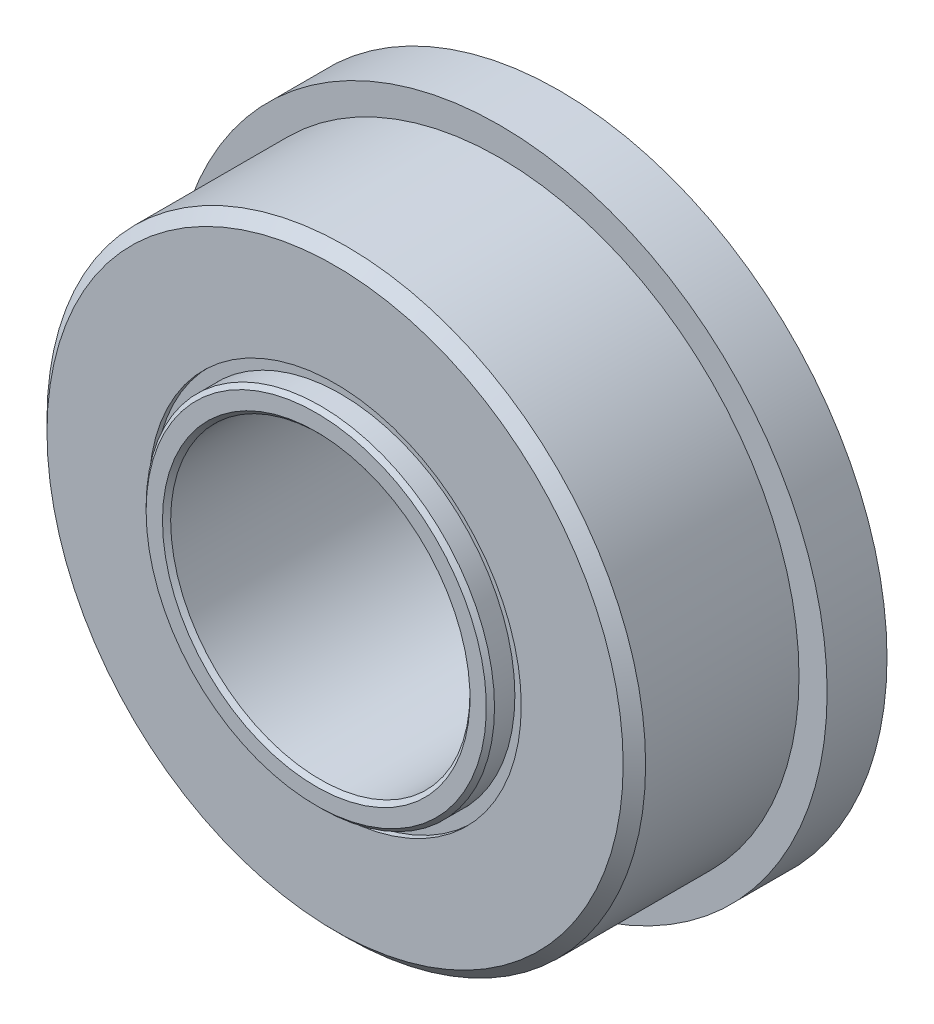
ISO-10303-21;
HEADER;
FILE_DESCRIPTION(('STEP AP214'),'2;1');
FILE_NAME('part.step','',(''),(''),'','','');
FILE_SCHEMA(('AUTOMOTIVE_DESIGN { 1 0 10303 214 1 1 1 1 }'));
ENDSEC;
DATA;
#1=APPLICATION_CONTEXT('core data for automotive mechanical design processes');
#2=APPLICATION_PROTOCOL_DEFINITION('international standard','automotive_design',2000,#1);
#3=PRODUCT_CONTEXT('',#1,'mechanical');
#4=PRODUCT('Part','Part','',(#3));
#5=PRODUCT_RELATED_PRODUCT_CATEGORY('part','',(#4));
#6=PRODUCT_DEFINITION_FORMATION('','',#4);
#7=PRODUCT_DEFINITION_CONTEXT('part definition',#1,'design');
#8=PRODUCT_DEFINITION('design','',#6,#7);
#9=PRODUCT_DEFINITION_SHAPE('','',#8);
#10=(LENGTH_UNIT() NAMED_UNIT(*) SI_UNIT(.MILLI.,.METRE.));
#11=(NAMED_UNIT(*) PLANE_ANGLE_UNIT() SI_UNIT($,.RADIAN.));
#12=(NAMED_UNIT(*) SI_UNIT($,.STERADIAN.) SOLID_ANGLE_UNIT());
#13=UNCERTAINTY_MEASURE_WITH_UNIT(LENGTH_MEASURE(1.E-05),#10,'distance_accuracy_value','');
#14=(GEOMETRIC_REPRESENTATION_CONTEXT(3) GLOBAL_UNCERTAINTY_ASSIGNED_CONTEXT((#13)) GLOBAL_UNIT_ASSIGNED_CONTEXT((#10,
#11,#12)) REPRESENTATION_CONTEXT('',''));
#15=CARTESIAN_POINT('',(0.,0.,0.));
#16=DIRECTION('',(0.,0.,1.));
#17=DIRECTION('',(1.,0.,0.));
#18=AXIS2_PLACEMENT_3D('',#15,#16,#17);
#19=CARTESIAN_POINT('',(0.,3.9497,-2.2621875));
#20=DIRECTION('',(0.,0.,1.));
#21=DIRECTION('',(1.,0.,0.));
#22=AXIS2_PLACEMENT_3D('',#19,#20,#21);
#23=PLANE('',#22);
#24=CARTESIAN_POINT('',(0.,0.,-2.2621875));
#25=DIRECTION('',(0.,0.,1.));
#26=DIRECTION('',(1.,0.,0.));
#27=AXIS2_PLACEMENT_3D('',#24,#25,#26);
#28=CIRCLE('',#27,3.9497);
#29=CARTESIAN_POINT('',(3.9497,0.,-2.2621875));
#30=VERTEX_POINT('',#29);
#31=EDGE_CURVE('E58',#30,#30,#28,.T.);
#32=ORIENTED_EDGE('',*,*,#31,.F.);
#33=EDGE_LOOP('',(#32));
#34=FACE_BOUND('',#33,.T.);
#35=CARTESIAN_POINT('',(0.,0.,-2.2621875));
#36=DIRECTION('',(0.,0.,1.));
#37=DIRECTION('',(1.,0.,0.));
#38=AXIS2_PLACEMENT_3D('',#35,#36,#37);
#39=CIRCLE('',#38,3.6957);
#40=CARTESIAN_POINT('',(3.6957,0.,-2.2621875));
#41=VERTEX_POINT('',#40);
#42=EDGE_CURVE('E11',#41,#41,#39,.T.);
#43=ORIENTED_EDGE('',*,*,#42,.T.);
#44=EDGE_LOOP('',(#43));
#45=FACE_BOUND('',#44,.T.);
#46=ADVANCED_FACE('F44',(#34,#45),#23,.F.);
#47=CARTESIAN_POINT('',(0.,0.,2.38125));
#48=DIRECTION('',(0.,0.,1.));
#49=DIRECTION('',(1.,0.,0.));
#50=AXIS2_PLACEMENT_3D('',#47,#48,#49);
#51=CYLINDRICAL_SURFACE('',#50,3.6957);
#52=ORIENTED_EDGE('',*,*,#42,.F.);
#53=EDGE_LOOP('',(#52));
#54=FACE_BOUND('',#53,.T.);
#55=CARTESIAN_POINT('',(0.,0.,-0.793750000000001));
#56=DIRECTION('',(0.,0.,1.));
#57=DIRECTION('',(1.,0.,0.));
#58=AXIS2_PLACEMENT_3D('',#55,#56,#57);
#59=CIRCLE('',#58,3.6957);
#60=CARTESIAN_POINT('',(3.6957,0.,-0.793750000000001));
#61=VERTEX_POINT('',#60);
#62=EDGE_CURVE('E50',#61,#61,#59,.T.);
#63=ORIENTED_EDGE('',*,*,#62,.T.);
#64=EDGE_LOOP('',(#63));
#65=FACE_BOUND('',#64,.T.);
#66=ADVANCED_FACE('F67',(#54,#65),#51,.F.);
#67=CARTESIAN_POINT('',(0.,3.9497,-0.793750000000001));
#68=DIRECTION('',(0.,0.,-1.));
#69=DIRECTION('',(-1.,0.,0.));
#70=AXIS2_PLACEMENT_3D('',#67,#68,#69);
#71=PLANE('',#70);
#72=ORIENTED_EDGE('',*,*,#62,.F.);
#73=EDGE_LOOP('',(#72));
#74=FACE_BOUND('',#73,.T.);
#75=CARTESIAN_POINT('',(0.,0.,-0.793750000000001));
#76=DIRECTION('',(0.,0.,1.));
#77=DIRECTION('',(1.,0.,0.));
#78=AXIS2_PLACEMENT_3D('',#75,#76,#77);
#79=CIRCLE('',#78,3.9497);
#80=CARTESIAN_POINT('',(3.9497,0.,-0.793750000000001));
#81=VERTEX_POINT('',#80);
#82=EDGE_CURVE('E54',#81,#81,#79,.T.);
#83=ORIENTED_EDGE('',*,*,#82,.T.);
#84=EDGE_LOOP('',(#83));
#85=FACE_BOUND('',#84,.T.);
#86=ADVANCED_FACE('F71',(#74,#85),#71,.F.);
#87=CARTESIAN_POINT('',(0.,0.,2.38125));
#88=DIRECTION('',(0.,0.,1.));
#89=DIRECTION('',(1.,0.,0.));
#90=AXIS2_PLACEMENT_3D('',#87,#88,#89);
#91=CYLINDRICAL_SURFACE('',#90,3.9497);
#92=ORIENTED_EDGE('',*,*,#82,.F.);
#93=EDGE_LOOP('',(#92));
#94=FACE_BOUND('',#93,.T.);
#95=ORIENTED_EDGE('',*,*,#31,.T.);
#96=EDGE_LOOP('',(#95));
#97=FACE_BOUND('',#96,.T.);
#98=ADVANCED_FACE('F64',(#94,#97),#91,.T.);
#99=CLOSED_SHELL('',(#46,#66,#86,#98));
#100=MANIFOLD_SOLID_BREP('B2',#99);
#101=CARTESIAN_POINT('',(0.,3.9497,2.2621875));
#102=DIRECTION('',(0.,0.,-1.));
#103=DIRECTION('',(-1.,0.,0.));
#104=AXIS2_PLACEMENT_3D('',#101,#102,#103);
#105=PLANE('',#104);
#106=CARTESIAN_POINT('',(0.,0.,2.2621875));
#107=DIRECTION('',(0.,0.,1.));
#108=DIRECTION('',(1.,0.,0.));
#109=AXIS2_PLACEMENT_3D('',#106,#107,#108);
#110=CIRCLE('',#109,3.6957);
#111=CARTESIAN_POINT('',(3.6957,0.,2.2621875));
#112=VERTEX_POINT('',#111);
#113=EDGE_CURVE('E43',#112,#112,#110,.T.);
#114=ORIENTED_EDGE('',*,*,#113,.F.);
#115=EDGE_LOOP('',(#114));
#116=FACE_BOUND('',#115,.T.);
#117=CARTESIAN_POINT('',(0.,0.,2.2621875));
#118=DIRECTION('',(0.,0.,1.));
#119=DIRECTION('',(1.,0.,0.));
#120=AXIS2_PLACEMENT_3D('',#117,#118,#119);
#121=CIRCLE('',#120,3.9497);
#122=CARTESIAN_POINT('',(3.9497,0.,2.2621875));
#123=VERTEX_POINT('',#122);
#124=EDGE_CURVE('E126',#123,#123,#121,.T.);
#125=ORIENTED_EDGE('',*,*,#124,.T.);
#126=EDGE_LOOP('',(#125));
#127=FACE_BOUND('',#126,.T.);
#128=ADVANCED_FACE('F112',(#116,#127),#105,.F.);
#129=CARTESIAN_POINT('',(0.,0.,2.38125));
#130=DIRECTION('',(0.,0.,1.));
#131=DIRECTION('',(1.,0.,0.));
#132=AXIS2_PLACEMENT_3D('',#129,#130,#131);
#133=CYLINDRICAL_SURFACE('',#132,3.6957);
#134=CARTESIAN_POINT('',(0.,0.,0.79375));
#135=DIRECTION('',(0.,0.,1.));
#136=DIRECTION('',(1.,0.,0.));
#137=AXIS2_PLACEMENT_3D('',#134,#135,#136);
#138=CIRCLE('',#137,3.6957);
#139=CARTESIAN_POINT('',(3.6957,0.,0.79375));
#140=VERTEX_POINT('',#139);
#141=EDGE_CURVE('E118',#140,#140,#138,.T.);
#142=ORIENTED_EDGE('',*,*,#141,.F.);
#143=EDGE_LOOP('',(#142));
#144=FACE_BOUND('',#143,.T.);
#145=ORIENTED_EDGE('',*,*,#113,.T.);
#146=EDGE_LOOP('',(#145));
#147=FACE_BOUND('',#146,.T.);
#148=ADVANCED_FACE('F141',(#144,#147),#133,.F.);
#149=CARTESIAN_POINT('',(0.,3.9497,0.79375));
#150=DIRECTION('',(0.,0.,1.));
#151=DIRECTION('',(1.,0.,0.));
#152=AXIS2_PLACEMENT_3D('',#149,#150,#151);
#153=PLANE('',#152);
#154=CARTESIAN_POINT('',(0.,0.,0.79375));
#155=DIRECTION('',(0.,0.,1.));
#156=DIRECTION('',(1.,0.,0.));
#157=AXIS2_PLACEMENT_3D('',#154,#155,#156);
#158=CIRCLE('',#157,3.9497);
#159=CARTESIAN_POINT('',(3.9497,0.,0.79375));
#160=VERTEX_POINT('',#159);
#161=EDGE_CURVE('E122',#160,#160,#158,.T.);
#162=ORIENTED_EDGE('',*,*,#161,.F.);
#163=EDGE_LOOP('',(#162));
#164=FACE_BOUND('',#163,.T.);
#165=ORIENTED_EDGE('',*,*,#141,.T.);
#166=EDGE_LOOP('',(#165));
#167=FACE_BOUND('',#166,.T.);
#168=ADVANCED_FACE('F136',(#164,#167),#153,.F.);
#169=CARTESIAN_POINT('',(0.,0.,2.38125));
#170=DIRECTION('',(0.,0.,1.));
#171=DIRECTION('',(1.,0.,0.));
#172=AXIS2_PLACEMENT_3D('',#169,#170,#171);
#173=CYLINDRICAL_SURFACE('',#172,3.9497);
#174=ORIENTED_EDGE('',*,*,#124,.F.);
#175=EDGE_LOOP('',(#174));
#176=FACE_BOUND('',#175,.T.);
#177=ORIENTED_EDGE('',*,*,#161,.T.);
#178=EDGE_LOOP('',(#177));
#179=FACE_BOUND('',#178,.T.);
#180=ADVANCED_FACE('F133',(#176,#179),#173,.T.);
#181=CLOSED_SHELL('',(#128,#148,#168,#180));
#182=MANIFOLD_SOLID_BREP('B6',#181);
#183=CARTESIAN_POINT('',(-2.11454999999995,3.6625080351448,0.));
#184=DIRECTION('',(0.,0.,1.));
#185=DIRECTION('',(-0.499999999999989,0.866025403784445,0.));
#186=AXIS2_PLACEMENT_3D('',#183,#184,#185);
#187=SPHERICAL_SURFACE('',#186,0.79375);
#188=CARTESIAN_POINT('',(-2.11454999999995,3.6625080351448,0.79375));
#189=VERTEX_POINT('',#188);
#190=VERTEX_LOOP('',#189);
#191=FACE_BOUND('',#190,.T.);
#192=ADVANCED_FACE('F180',(#191),#187,.T.);
#193=CLOSED_SHELL('',(#192));
#194=MANIFOLD_SOLID_BREP('B38',#193);
#195=CARTESIAN_POINT('',(-3.66250803514474,2.11455000000004,0.));
#196=DIRECTION('',(0.,0.,1.));
#197=DIRECTION('',(-0.866025403784433,0.50000000000001,0.));
#198=AXIS2_PLACEMENT_3D('',#195,#196,#197);
#199=SPHERICAL_SURFACE('',#198,0.79375);
#200=CARTESIAN_POINT('',(-3.66250803514474,2.11455000000004,0.79375));
#201=VERTEX_POINT('',#200);
#202=VERTEX_LOOP('',#201);
#203=FACE_BOUND('',#202,.T.);
#204=ADVANCED_FACE('F201',(#203),#199,.T.);
#205=CLOSED_SHELL('',(#204));
#206=MANIFOLD_SOLID_BREP('B108',#205);
#207=CARTESIAN_POINT('',(-4.2291,0.,0.));
#208=DIRECTION('',(0.,0.,1.));
#209=DIRECTION('',(-1.,0.,0.));
#210=AXIS2_PLACEMENT_3D('',#207,#208,#209);
#211=SPHERICAL_SURFACE('',#210,0.79375);
#212=CARTESIAN_POINT('',(-4.2291,0.,0.79375));
#213=VERTEX_POINT('',#212);
#214=VERTEX_LOOP('',#213);
#215=FACE_BOUND('',#214,.T.);
#216=ADVANCED_FACE('F222',(#215),#211,.T.);
#217=CLOSED_SHELL('',(#216));
#218=MANIFOLD_SOLID_BREP('B176',#217);
#219=CARTESIAN_POINT('',(-3.66250803514479,-2.11454999999997,0.));
#220=DIRECTION('',(0.,0.,1.));
#221=DIRECTION('',(-0.866025403784443,-0.499999999999992,0.));
#222=AXIS2_PLACEMENT_3D('',#219,#220,#221);
#223=SPHERICAL_SURFACE('',#222,0.79375);
#224=CARTESIAN_POINT('',(-3.66250803514479,-2.11454999999997,0.79375));
#225=VERTEX_POINT('',#224);
#226=VERTEX_LOOP('',#225);
#227=FACE_BOUND('',#226,.T.);
#228=ADVANCED_FACE('F243',(#227),#223,.T.);
#229=CLOSED_SHELL('',(#228));
#230=MANIFOLD_SOLID_BREP('B197',#229);
#231=CARTESIAN_POINT('',(-2.11455000000003,-3.66250803514475,0.));
#232=DIRECTION('',(0.,0.,1.));
#233=DIRECTION('',(-0.500000000000007,-0.866025403784435,0.));
#234=AXIS2_PLACEMENT_3D('',#231,#232,#233);
#235=SPHERICAL_SURFACE('',#234,0.79375);
#236=CARTESIAN_POINT('',(-2.11455000000003,-3.66250803514475,0.79375));
#237=VERTEX_POINT('',#236);
#238=VERTEX_LOOP('',#237);
#239=FACE_BOUND('',#238,.T.);
#240=ADVANCED_FACE('F264',(#239),#235,.T.);
#241=CLOSED_SHELL('',(#240));
#242=MANIFOLD_SOLID_BREP('B218',#241);
#243=CARTESIAN_POINT('',(0.,-4.2291,0.));
#244=DIRECTION('',(0.,0.,1.));
#245=DIRECTION('',(0.,-1.,0.));
#246=AXIS2_PLACEMENT_3D('',#243,#244,#245);
#247=SPHERICAL_SURFACE('',#246,0.79375);
#248=CARTESIAN_POINT('',(0.,-4.2291,0.79375));
#249=VERTEX_POINT('',#248);
#250=VERTEX_LOOP('',#249);
#251=FACE_BOUND('',#250,.T.);
#252=ADVANCED_FACE('F285',(#251),#247,.T.);
#253=CLOSED_SHELL('',(#252));
#254=MANIFOLD_SOLID_BREP('B239',#253);
#255=CARTESIAN_POINT('',(2.11454999999998,-3.66250803514478,0.));
#256=DIRECTION('',(0.,0.,1.));
#257=DIRECTION('',(0.499999999999995,-0.866025403784442,0.));
#258=AXIS2_PLACEMENT_3D('',#255,#256,#257);
#259=SPHERICAL_SURFACE('',#258,0.79375);
#260=CARTESIAN_POINT('',(2.11454999999998,-3.66250803514478,0.79375));
#261=VERTEX_POINT('',#260);
#262=VERTEX_LOOP('',#261);
#263=FACE_BOUND('',#262,.T.);
#264=ADVANCED_FACE('F306',(#263),#259,.T.);
#265=CLOSED_SHELL('',(#264));
#266=MANIFOLD_SOLID_BREP('B260',#265);
#267=CARTESIAN_POINT('',(3.66250803514476,-2.11455000000002,0.));
#268=DIRECTION('',(0.,0.,1.));
#269=DIRECTION('',(0.866025403784436,-0.500000000000004,0.));
#270=AXIS2_PLACEMENT_3D('',#267,#268,#269);
#271=SPHERICAL_SURFACE('',#270,0.79375);
#272=CARTESIAN_POINT('',(3.66250803514476,-2.11455000000002,0.79375));
#273=VERTEX_POINT('',#272);
#274=VERTEX_LOOP('',#273);
#275=FACE_BOUND('',#274,.T.);
#276=ADVANCED_FACE('F327',(#275),#271,.T.);
#277=CLOSED_SHELL('',(#276));
#278=MANIFOLD_SOLID_BREP('B281',#277);
#279=CARTESIAN_POINT('',(4.2291,0.,0.));
#280=DIRECTION('',(0.,0.,1.));
#281=DIRECTION('',(1.,0.,0.));
#282=AXIS2_PLACEMENT_3D('',#279,#280,#281);
#283=SPHERICAL_SURFACE('',#282,0.79375);
#284=CARTESIAN_POINT('',(4.2291,0.,0.79375));
#285=VERTEX_POINT('',#284);
#286=VERTEX_LOOP('',#285);
#287=FACE_BOUND('',#286,.T.);
#288=ADVANCED_FACE('F348',(#287),#283,.T.);
#289=CLOSED_SHELL('',(#288));
#290=MANIFOLD_SOLID_BREP('B302',#289);
#291=CARTESIAN_POINT('',(3.66250803514477,2.11454999999999,0.));
#292=DIRECTION('',(0.,0.,1.));
#293=DIRECTION('',(0.86602540378444,0.499999999999998,0.));
#294=AXIS2_PLACEMENT_3D('',#291,#292,#293);
#295=SPHERICAL_SURFACE('',#294,0.79375);
#296=CARTESIAN_POINT('',(3.66250803514477,2.11454999999999,0.79375));
#297=VERTEX_POINT('',#296);
#298=VERTEX_LOOP('',#297);
#299=FACE_BOUND('',#298,.T.);
#300=ADVANCED_FACE('F369',(#299),#295,.T.);
#301=CLOSED_SHELL('',(#300));
#302=MANIFOLD_SOLID_BREP('B323',#301);
#303=CARTESIAN_POINT('',(2.11455,3.66250803514477,0.));
#304=DIRECTION('',(0.,0.,1.));
#305=DIRECTION('',(0.500000000000001,0.866025403784438,0.));
#306=AXIS2_PLACEMENT_3D('',#303,#304,#305);
#307=SPHERICAL_SURFACE('',#306,0.79375);
#308=CARTESIAN_POINT('',(2.11455,3.66250803514477,0.79375));
#309=VERTEX_POINT('',#308);
#310=VERTEX_LOOP('',#309);
#311=FACE_BOUND('',#310,.T.);
#312=ADVANCED_FACE('F390',(#311),#307,.T.);
#313=CLOSED_SHELL('',(#312));
#314=MANIFOLD_SOLID_BREP('B344',#313);
#315=CARTESIAN_POINT('',(0.,4.2291,0.));
#316=DIRECTION('',(0.,0.,1.));
#317=DIRECTION('',(0.,1.,0.));
#318=AXIS2_PLACEMENT_3D('',#315,#316,#317);
#319=SPHERICAL_SURFACE('',#318,0.79375);
#320=CARTESIAN_POINT('',(0.,4.2291,0.79375));
#321=VERTEX_POINT('',#320);
#322=VERTEX_LOOP('',#321);
#323=FACE_BOUND('',#322,.T.);
#324=ADVANCED_FACE('F413',(#323),#319,.T.);
#325=CLOSED_SHELL('',(#324));
#326=MANIFOLD_SOLID_BREP('B365',#325);
#327=CARTESIAN_POINT('',(0.,0.,2.38125));
#328=DIRECTION('',(0.,0.,1.));
#329=DIRECTION('',(1.,0.,0.));
#330=AXIS2_PLACEMENT_3D('',#327,#328,#329);
#331=CYLINDRICAL_SURFACE('',#330,3.6957);
#332=CARTESIAN_POINT('',(0.,0.,2.69451666666667));
#333=DIRECTION('',(0.,0.,-1.));
#334=DIRECTION('',(-1.,0.,0.));
#335=AXIS2_PLACEMENT_3D('',#332,#333,#334);
#336=CIRCLE('',#335,3.6957);
#337=CARTESIAN_POINT('',(-3.6957,0.,2.69451666666667));
#338=VERTEX_POINT('',#337);
#339=EDGE_CURVE('E412',#338,#338,#336,.T.);
#340=ORIENTED_EDGE('',*,*,#339,.T.);
#341=EDGE_LOOP('',(#340));
#342=FACE_BOUND('',#341,.T.);
#343=CARTESIAN_POINT('',(0.,0.,0.587812472222221));
#344=DIRECTION('',(0.,0.,1.));
#345=DIRECTION('',(1.,0.,0.));
#346=AXIS2_PLACEMENT_3D('',#343,#344,#345);
#347=CIRCLE('',#346,3.6957);
#348=CARTESIAN_POINT('',(3.6957,0.,0.587812472222221));
#349=VERTEX_POINT('',#348);
#350=EDGE_CURVE('E468',#349,#349,#347,.T.);
#351=ORIENTED_EDGE('',*,*,#350,.T.);
#352=EDGE_LOOP('',(#351));
#353=FACE_BOUND('',#352,.T.);
#354=ADVANCED_FACE('F433',(#342,#353),#331,.T.);
#355=CARTESIAN_POINT('',(0.,3.6957,2.7813));
#356=DIRECTION('',(0.,0.,-1.));
#357=DIRECTION('',(-1.,0.,0.));
#358=AXIS2_PLACEMENT_3D('',#355,#356,#357);
#359=PLANE('',#358);
#360=CARTESIAN_POINT('',(0.,0.,2.7813));
#361=DIRECTION('',(0.,0.,-1.));
#362=DIRECTION('',(-1.,0.,0.));
#363=AXIS2_PLACEMENT_3D('',#360,#361,#362);
#364=CIRCLE('',#363,3.60891666666666);
#365=CARTESIAN_POINT('',(-3.60891666666666,0.,2.7813));
#366=VERTEX_POINT('',#365);
#367=EDGE_CURVE('E440',#366,#366,#364,.F.);
#368=ORIENTED_EDGE('',*,*,#367,.T.);
#369=EDGE_LOOP('',(#368));
#370=FACE_BOUND('',#369,.T.);
#371=CARTESIAN_POINT('',(0.,0.,2.7813));
#372=DIRECTION('',(0.,0.,-1.));
#373=DIRECTION('',(-1.,0.,0.));
#374=AXIS2_PLACEMENT_3D('',#371,#372,#373);
#375=CIRCLE('',#374,3.26178333333333);
#376=CARTESIAN_POINT('',(-3.26178333333333,0.,2.7813));
#377=VERTEX_POINT('',#376);
#378=EDGE_CURVE('E444',#377,#377,#375,.T.);
#379=ORIENTED_EDGE('',*,*,#378,.T.);
#380=EDGE_LOOP('',(#379));
#381=FACE_BOUND('',#380,.T.);
#382=ADVANCED_FACE('F492',(#370,#381),#359,.F.);
#383=CARTESIAN_POINT('',(0.,0.,2.38125));
#384=DIRECTION('',(0.,0.,1.));
#385=DIRECTION('',(1.,0.,0.));
#386=AXIS2_PLACEMENT_3D('',#383,#384,#385);
#387=CYLINDRICAL_SURFACE('',#386,3.175);
#388=CARTESIAN_POINT('',(0.,0.,-2.69451666666667));
#389=DIRECTION('',(0.,0.,1.));
#390=DIRECTION('',(1.,0.,0.));
#391=AXIS2_PLACEMENT_3D('',#388,#389,#390);
#392=CIRCLE('',#391,3.175);
#393=CARTESIAN_POINT('',(3.175,0.,-2.69451666666667));
#394=VERTEX_POINT('',#393);
#395=EDGE_CURVE('E453',#394,#394,#392,.F.);
#396=ORIENTED_EDGE('',*,*,#395,.T.);
#397=EDGE_LOOP('',(#396));
#398=FACE_BOUND('',#397,.T.);
#399=CARTESIAN_POINT('',(0.,0.,2.69451666666667));
#400=DIRECTION('',(0.,0.,-1.));
#401=DIRECTION('',(-1.,0.,0.));
#402=AXIS2_PLACEMENT_3D('',#399,#400,#401);
#403=CIRCLE('',#402,3.175);
#404=CARTESIAN_POINT('',(-3.175,0.,2.69451666666667));
#405=VERTEX_POINT('',#404);
#406=EDGE_CURVE('E456',#405,#405,#403,.F.);
#407=ORIENTED_EDGE('',*,*,#406,.T.);
#408=EDGE_LOOP('',(#407));
#409=FACE_BOUND('',#408,.T.);
#410=ADVANCED_FACE('F488',(#398,#409),#387,.F.);
#411=CARTESIAN_POINT('',(0.,3.175,-2.7813));
#412=DIRECTION('',(0.,0.,1.));
#413=DIRECTION('',(1.,0.,0.));
#414=AXIS2_PLACEMENT_3D('',#411,#412,#413);
#415=PLANE('',#414);
#416=CARTESIAN_POINT('',(0.,0.,-2.7813));
#417=DIRECTION('',(0.,0.,1.));
#418=DIRECTION('',(1.,0.,0.));
#419=AXIS2_PLACEMENT_3D('',#416,#417,#418);
#420=CIRCLE('',#419,3.26178333333333);
#421=CARTESIAN_POINT('',(3.26178333333333,0.,-2.7813));
#422=VERTEX_POINT('',#421);
#423=EDGE_CURVE('E459',#422,#422,#420,.T.);
#424=ORIENTED_EDGE('',*,*,#423,.T.);
#425=EDGE_LOOP('',(#424));
#426=FACE_BOUND('',#425,.T.);
#427=CARTESIAN_POINT('',(0.,0.,-2.7813));
#428=DIRECTION('',(0.,0.,1.));
#429=DIRECTION('',(1.,0.,0.));
#430=AXIS2_PLACEMENT_3D('',#427,#428,#429);
#431=CIRCLE('',#430,3.60891666666667);
#432=CARTESIAN_POINT('',(3.60891666666667,0.,-2.7813));
#433=VERTEX_POINT('',#432);
#434=EDGE_CURVE('E462',#433,#433,#431,.F.);
#435=ORIENTED_EDGE('',*,*,#434,.T.);
#436=EDGE_LOOP('',(#435));
#437=FACE_BOUND('',#436,.T.);
#438=ADVANCED_FACE('F482',(#426,#437),#415,.F.);
#439=CARTESIAN_POINT('',(0.,0.,2.38125));
#440=DIRECTION('',(0.,0.,1.));
#441=DIRECTION('',(1.,0.,0.));
#442=AXIS2_PLACEMENT_3D('',#439,#440,#441);
#443=CYLINDRICAL_SURFACE('',#442,3.6957);
#444=CARTESIAN_POINT('',(0.,0.,-2.69451666666667));
#445=DIRECTION('',(0.,0.,1.));
#446=DIRECTION('',(1.,0.,0.));
#447=AXIS2_PLACEMENT_3D('',#444,#445,#446);
#448=CIRCLE('',#447,3.6957);
#449=CARTESIAN_POINT('',(3.6957,0.,-2.69451666666667));
#450=VERTEX_POINT('',#449);
#451=EDGE_CURVE('E448',#450,#450,#448,.T.);
#452=ORIENTED_EDGE('',*,*,#451,.T.);
#453=EDGE_LOOP('',(#452));
#454=FACE_BOUND('',#453,.T.);
#455=CARTESIAN_POINT('',(0.,0.,-0.587812472222221));
#456=DIRECTION('',(0.,0.,1.));
#457=DIRECTION('',(1.,0.,0.));
#458=AXIS2_PLACEMENT_3D('',#455,#456,#457);
#459=CIRCLE('',#458,3.6957);
#460=CARTESIAN_POINT('',(3.6957,0.,-0.587812472222221));
#461=VERTEX_POINT('',#460);
#462=EDGE_CURVE('E465',#461,#461,#459,.T.);
#463=ORIENTED_EDGE('',*,*,#462,.F.);
#464=EDGE_LOOP('',(#463));
#465=FACE_BOUND('',#464,.T.);
#466=ADVANCED_FACE('F477',(#454,#465),#443,.T.);
#467=CARTESIAN_POINT('',(0.,0.,0.));
#468=DIRECTION('',(0.,0.,1.));
#469=DIRECTION('',(1.,0.,0.));
#470=AXIS2_PLACEMENT_3D('',#467,#468,#469);
#471=TOROIDAL_SURFACE('',#470,4.2291,0.79375);
#472=ORIENTED_EDGE('',*,*,#350,.F.);
#473=EDGE_LOOP('',(#472));
#474=FACE_BOUND('',#473,.T.);
#475=ORIENTED_EDGE('',*,*,#462,.T.);
#476=EDGE_LOOP('',(#475));
#477=FACE_BOUND('',#476,.T.);
#478=ADVANCED_FACE('F473',(#474,#477),#471,.F.);
#479=CARTESIAN_POINT('',(0.,0.,-2.7813));
#480=DIRECTION('',(0.,0.,-1.));
#481=DIRECTION('',(-1.,0.,0.));
#482=AXIS2_PLACEMENT_3D('',#479,#480,#481);
#483=CONICAL_SURFACE('',#482,3.26178333333333,0.785398163397446);
#484=ORIENTED_EDGE('',*,*,#395,.F.);
#485=EDGE_LOOP('',(#484));
#486=FACE_BOUND('',#485,.T.);
#487=ORIENTED_EDGE('',*,*,#423,.F.);
#488=EDGE_LOOP('',(#487));
#489=FACE_BOUND('',#488,.T.);
#490=ADVANCED_FACE('F476',(#486,#489),#483,.F.);
#491=CARTESIAN_POINT('',(0.,0.,-2.69451666666667));
#492=DIRECTION('',(0.,0.,1.));
#493=DIRECTION('',(1.,0.,0.));
#494=AXIS2_PLACEMENT_3D('',#491,#492,#493);
#495=CONICAL_SURFACE('',#494,3.6957,0.785398163397451);
#496=ORIENTED_EDGE('',*,*,#434,.F.);
#497=EDGE_LOOP('',(#496));
#498=FACE_BOUND('',#497,.T.);
#499=ORIENTED_EDGE('',*,*,#451,.F.);
#500=EDGE_LOOP('',(#499));
#501=FACE_BOUND('',#500,.T.);
#502=ADVANCED_FACE('F502',(#498,#501),#495,.T.);
#503=CARTESIAN_POINT('',(0.,0.,2.7813));
#504=DIRECTION('',(0.,0.,-1.));
#505=DIRECTION('',(-1.,0.,0.));
#506=AXIS2_PLACEMENT_3D('',#503,#504,#505);
#507=CONICAL_SURFACE('',#506,3.60891666666666,0.785398163397448);
#508=ORIENTED_EDGE('',*,*,#339,.F.);
#509=EDGE_LOOP('',(#508));
#510=FACE_BOUND('',#509,.T.);
#511=ORIENTED_EDGE('',*,*,#367,.F.);
#512=EDGE_LOOP('',(#511));
#513=FACE_BOUND('',#512,.T.);
#514=ADVANCED_FACE('F505',(#510,#513),#507,.T.);
#515=CARTESIAN_POINT('',(0.,0.,2.69451666666667));
#516=DIRECTION('',(0.,0.,1.));
#517=DIRECTION('',(1.,0.,0.));
#518=AXIS2_PLACEMENT_3D('',#515,#516,#517);
#519=CONICAL_SURFACE('',#518,3.175,0.785398163397448);
#520=ORIENTED_EDGE('',*,*,#378,.F.);
#521=EDGE_LOOP('',(#520));
#522=FACE_BOUND('',#521,.T.);
#523=ORIENTED_EDGE('',*,*,#406,.F.);
#524=EDGE_LOOP('',(#523));
#525=FACE_BOUND('',#524,.T.);
#526=ADVANCED_FACE('F435',(#522,#525),#519,.F.);
#527=CLOSED_SHELL('',(#354,#382,#410,#438,#466,#478,#490,#502,#514,#526));
#528=MANIFOLD_SOLID_BREP('B386',#527);
#529=CARTESIAN_POINT('',(0.,0.,2.143125));
#530=DIRECTION('',(0.,0.,-1.));
#531=DIRECTION('',(-1.,0.,0.));
#532=AXIS2_PLACEMENT_3D('',#529,#530,#531);
#533=CONICAL_SURFACE('',#532,6.35,0.785398163397447);
#534=CARTESIAN_POINT('',(0.,0.,2.38125));
#535=DIRECTION('',(0.,0.,1.));
#536=DIRECTION('',(1.,0.,0.));
#537=AXIS2_PLACEMENT_3D('',#534,#535,#536);
#538=CIRCLE('',#537,6.111875);
#539=CARTESIAN_POINT('',(6.111875,0.,2.38125));
#540=VERTEX_POINT('',#539);
#541=EDGE_CURVE('E607',#540,#540,#538,.T.);
#542=ORIENTED_EDGE('',*,*,#541,.F.);
#543=EDGE_LOOP('',(#542));
#544=FACE_BOUND('',#543,.T.);
#545=CARTESIAN_POINT('',(0.,0.,2.143125));
#546=DIRECTION('',(0.,0.,1.));
#547=DIRECTION('',(1.,0.,0.));
#548=AXIS2_PLACEMENT_3D('',#545,#546,#547);
#549=CIRCLE('',#548,6.35);
#550=CARTESIAN_POINT('',(6.35,0.,2.143125));
#551=VERTEX_POINT('',#550);
#552=EDGE_CURVE('E432',#551,#551,#549,.T.);
#553=ORIENTED_EDGE('',*,*,#552,.T.);
#554=EDGE_LOOP('',(#553));
#555=FACE_BOUND('',#554,.T.);
#556=ADVANCED_FACE('F585',(#544,#555),#533,.T.);
#557=CARTESIAN_POINT('',(0.,0.,2.38125));
#558=DIRECTION('',(0.,0.,1.));
#559=DIRECTION('',(1.,0.,0.));
#560=AXIS2_PLACEMENT_3D('',#557,#558,#559);
#561=CYLINDRICAL_SURFACE('',#560,6.35);
#562=CARTESIAN_POINT('',(0.,0.,-1.11125));
#563=DIRECTION('',(0.,0.,1.));
#564=DIRECTION('',(1.,0.,0.));
#565=AXIS2_PLACEMENT_3D('',#562,#563,#564);
#566=CIRCLE('',#565,6.35);
#567=CARTESIAN_POINT('',(6.35,0.,-1.11125));
#568=VERTEX_POINT('',#567);
#569=EDGE_CURVE('E610',#568,#568,#566,.T.);
#570=ORIENTED_EDGE('',*,*,#569,.T.);
#571=EDGE_LOOP('',(#570));
#572=FACE_BOUND('',#571,.T.);
#573=ORIENTED_EDGE('',*,*,#552,.F.);
#574=EDGE_LOOP('',(#573));
#575=FACE_BOUND('',#574,.T.);
#576=ADVANCED_FACE('F630',(#572,#575),#561,.T.);
#577=CARTESIAN_POINT('',(0.,6.111875,-2.38125));
#578=DIRECTION('',(0.,0.,1.));
#579=DIRECTION('',(1.,0.,0.));
#580=AXIS2_PLACEMENT_3D('',#577,#578,#579);
#581=PLANE('',#580);
#582=CARTESIAN_POINT('',(0.,0.,-2.38125));
#583=DIRECTION('',(0.,0.,1.));
#584=DIRECTION('',(1.,0.,0.));
#585=AXIS2_PLACEMENT_3D('',#582,#583,#584);
#586=CIRCLE('',#585,3.9497);
#587=CARTESIAN_POINT('',(3.9497,0.,-2.38125));
#588=VERTEX_POINT('',#587);
#589=EDGE_CURVE('E591',#588,#588,#586,.T.);
#590=ORIENTED_EDGE('',*,*,#589,.T.);
#591=EDGE_LOOP('',(#590));
#592=FACE_BOUND('',#591,.T.);
#593=CARTESIAN_POINT('',(0.,0.,-2.38125));
#594=DIRECTION('',(0.,0.,-1.));
#595=DIRECTION('',(-1.,0.,0.));
#596=AXIS2_PLACEMENT_3D('',#593,#594,#595);
#597=CIRCLE('',#596,6.9469);
#598=CARTESIAN_POINT('',(-6.9469,0.,-2.38125));
#599=VERTEX_POINT('',#598);
#600=EDGE_CURVE('E613',#599,#599,#597,.T.);
#601=ORIENTED_EDGE('',*,*,#600,.T.);
#602=EDGE_LOOP('',(#601));
#603=FACE_BOUND('',#602,.T.);
#604=ADVANCED_FACE('F633',(#592,#603),#581,.F.);
#605=CARTESIAN_POINT('',(0.,0.,2.38125));
#606=DIRECTION('',(0.,0.,1.));
#607=DIRECTION('',(1.,0.,0.));
#608=AXIS2_PLACEMENT_3D('',#605,#606,#607);
#609=CYLINDRICAL_SURFACE('',#608,3.9497);
#610=CARTESIAN_POINT('',(0.,0.,-0.74295));
#611=DIRECTION('',(0.,0.,1.));
#612=DIRECTION('',(1.,0.,0.));
#613=AXIS2_PLACEMENT_3D('',#610,#611,#612);
#614=CIRCLE('',#613,3.9497);
#615=CARTESIAN_POINT('',(3.9497,0.,-0.74295));
#616=VERTEX_POINT('',#615);
#617=EDGE_CURVE('E595',#616,#616,#614,.T.);
#618=ORIENTED_EDGE('',*,*,#617,.T.);
#619=EDGE_LOOP('',(#618));
#620=FACE_BOUND('',#619,.T.);
#621=ORIENTED_EDGE('',*,*,#589,.F.);
#622=EDGE_LOOP('',(#621));
#623=FACE_BOUND('',#622,.T.);
#624=ADVANCED_FACE('F638',(#620,#623),#609,.F.);
#625=CARTESIAN_POINT('',(0.,0.,0.));
#626=DIRECTION('',(0.,0.,1.));
#627=DIRECTION('',(1.,0.,0.));
#628=AXIS2_PLACEMENT_3D('',#625,#626,#627);
#629=TOROIDAL_SURFACE('',#628,4.2291,0.79375);
#630=ORIENTED_EDGE('',*,*,#617,.F.);
#631=EDGE_LOOP('',(#630));
#632=FACE_BOUND('',#631,.T.);
#633=CARTESIAN_POINT('',(0.,0.,0.74295));
#634=DIRECTION('',(0.,0.,1.));
#635=DIRECTION('',(1.,0.,0.));
#636=AXIS2_PLACEMENT_3D('',#633,#634,#635);
#637=CIRCLE('',#636,3.9497);
#638=CARTESIAN_POINT('',(3.9497,0.,0.74295));
#639=VERTEX_POINT('',#638);
#640=EDGE_CURVE('E599',#639,#639,#637,.T.);
#641=ORIENTED_EDGE('',*,*,#640,.T.);
#642=EDGE_LOOP('',(#641));
#643=FACE_BOUND('',#642,.T.);
#644=ADVANCED_FACE('F644',(#632,#643),#629,.F.);
#645=CARTESIAN_POINT('',(0.,0.,2.38125));
#646=DIRECTION('',(0.,0.,1.));
#647=DIRECTION('',(1.,0.,0.));
#648=AXIS2_PLACEMENT_3D('',#645,#646,#647);
#649=CYLINDRICAL_SURFACE('',#648,3.9497);
#650=ORIENTED_EDGE('',*,*,#640,.F.);
#651=EDGE_LOOP('',(#650));
#652=FACE_BOUND('',#651,.T.);
#653=CARTESIAN_POINT('',(0.,0.,2.38125));
#654=DIRECTION('',(0.,0.,1.));
#655=DIRECTION('',(1.,0.,0.));
#656=AXIS2_PLACEMENT_3D('',#653,#654,#655);
#657=CIRCLE('',#656,3.9497);
#658=CARTESIAN_POINT('',(3.9497,0.,2.38125));
#659=VERTEX_POINT('',#658);
#660=EDGE_CURVE('E604',#659,#659,#657,.T.);
#661=ORIENTED_EDGE('',*,*,#660,.T.);
#662=EDGE_LOOP('',(#661));
#663=FACE_BOUND('',#662,.T.);
#664=ADVANCED_FACE('F648',(#652,#663),#649,.F.);
#665=CARTESIAN_POINT('',(0.,6.111875,2.38125));
#666=DIRECTION('',(0.,0.,-1.));
#667=DIRECTION('',(-1.,0.,0.));
#668=AXIS2_PLACEMENT_3D('',#665,#666,#667);
#669=PLANE('',#668);
#670=ORIENTED_EDGE('',*,*,#660,.F.);
#671=EDGE_LOOP('',(#670));
#672=FACE_BOUND('',#671,.T.);
#673=ORIENTED_EDGE('',*,*,#541,.T.);
#674=EDGE_LOOP('',(#673));
#675=FACE_BOUND('',#674,.T.);
#676=ADVANCED_FACE('F626',(#672,#675),#669,.F.);
#677=CARTESIAN_POINT('',(0.,3.9497,-1.11125));
#678=DIRECTION('',(0.,0.,1.));
#679=DIRECTION('',(1.,0.,0.));
#680=AXIS2_PLACEMENT_3D('',#677,#678,#679);
#681=PLANE('',#680);
#682=CARTESIAN_POINT('',(0.,0.,-1.11125));
#683=DIRECTION('',(0.,0.,-1.));
#684=DIRECTION('',(-1.,0.,0.));
#685=AXIS2_PLACEMENT_3D('',#682,#683,#684);
#686=CIRCLE('',#685,6.9469);
#687=CARTESIAN_POINT('',(-6.9469,0.,-1.11125));
#688=VERTEX_POINT('',#687);
#689=EDGE_CURVE('E616',#688,#688,#686,.T.);
#690=ORIENTED_EDGE('',*,*,#689,.F.);
#691=EDGE_LOOP('',(#690));
#692=FACE_BOUND('',#691,.T.);
#693=ORIENTED_EDGE('',*,*,#569,.F.);
#694=EDGE_LOOP('',(#693));
#695=FACE_BOUND('',#694,.T.);
#696=ADVANCED_FACE('F623',(#692,#695),#681,.T.);
#697=CARTESIAN_POINT('',(0.,0.,-2.38125));
#698=DIRECTION('',(0.,0.,-1.));
#699=DIRECTION('',(-1.,0.,0.));
#700=AXIS2_PLACEMENT_3D('',#697,#698,#699);
#701=CYLINDRICAL_SURFACE('',#700,6.9469);
#702=ORIENTED_EDGE('',*,*,#689,.T.);
#703=EDGE_LOOP('',(#702));
#704=FACE_BOUND('',#703,.T.);
#705=ORIENTED_EDGE('',*,*,#600,.F.);
#706=EDGE_LOOP('',(#705));
#707=FACE_BOUND('',#706,.T.);
#708=ADVANCED_FACE('F620',(#704,#707),#701,.T.);
#709=CLOSED_SHELL('',(#556,#576,#604,#624,#644,#664,#676,#696,#708));
#710=MANIFOLD_SOLID_BREP('B407',#709);
#711=ADVANCED_BREP_SHAPE_REPRESENTATION('',(#18,#100,#182,#194,#206,#218,#230,#242,#254,#266,
#278,#290,#302,#314,#326,#528,#710),#14);
#712=SHAPE_DEFINITION_REPRESENTATION(#9,#711);
ENDSEC;
END-ISO-10303-21;
